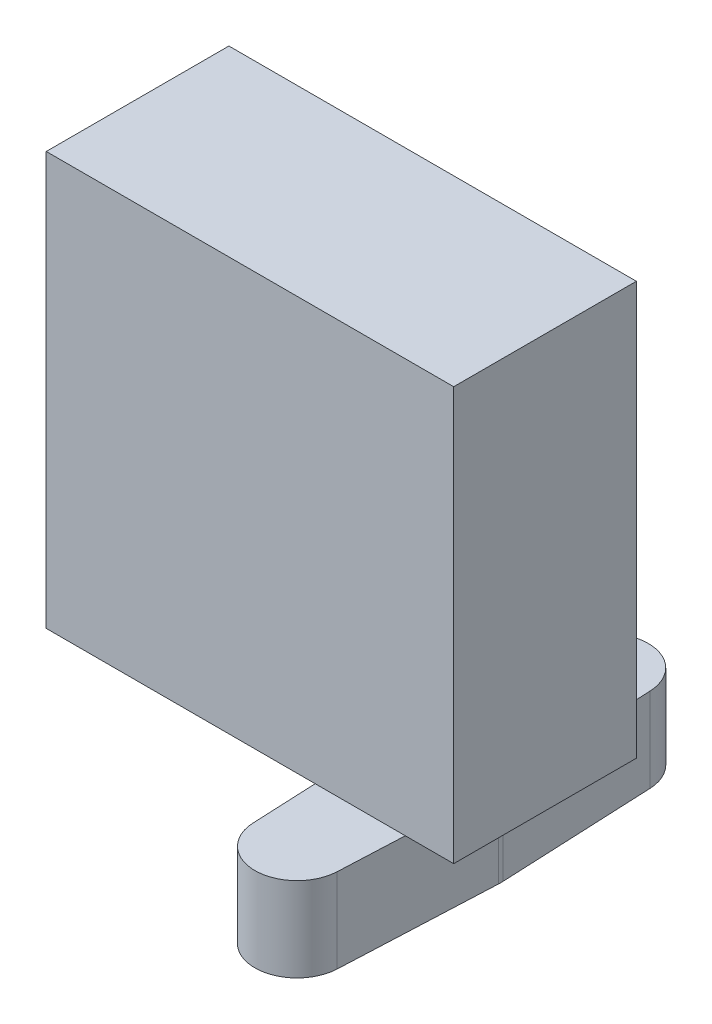
ISO-10303-21;
HEADER;
FILE_DESCRIPTION(('STEP AP214'),'2;1');
FILE_NAME('part.step','',(''),(''),'','','');
FILE_SCHEMA(('AUTOMOTIVE_DESIGN { 1 0 10303 214 1 1 1 1 }'));
ENDSEC;
DATA;
#1=APPLICATION_CONTEXT('core data for automotive mechanical design processes');
#2=APPLICATION_PROTOCOL_DEFINITION('international standard','automotive_design',2000,#1);
#3=PRODUCT_CONTEXT('',#1,'mechanical');
#4=PRODUCT('Part','Part','',(#3));
#5=PRODUCT_RELATED_PRODUCT_CATEGORY('part','',(#4));
#6=PRODUCT_DEFINITION_FORMATION('','',#4);
#7=PRODUCT_DEFINITION_CONTEXT('part definition',#1,'design');
#8=PRODUCT_DEFINITION('design','',#6,#7);
#9=PRODUCT_DEFINITION_SHAPE('','',#8);
#10=(LENGTH_UNIT() NAMED_UNIT(*) SI_UNIT(.MILLI.,.METRE.));
#11=(NAMED_UNIT(*) PLANE_ANGLE_UNIT() SI_UNIT($,.RADIAN.));
#12=(NAMED_UNIT(*) SI_UNIT($,.STERADIAN.) SOLID_ANGLE_UNIT());
#13=UNCERTAINTY_MEASURE_WITH_UNIT(LENGTH_MEASURE(1.E-05),#10,'distance_accuracy_value','');
#14=(GEOMETRIC_REPRESENTATION_CONTEXT(3) GLOBAL_UNCERTAINTY_ASSIGNED_CONTEXT((#13)) GLOBAL_UNIT_ASSIGNED_CONTEXT((#10,
#11,#12)) REPRESENTATION_CONTEXT('',''));
#15=CARTESIAN_POINT('',(0.,0.,0.));
#16=DIRECTION('',(0.,0.,1.));
#17=DIRECTION('',(1.,0.,0.));
#18=AXIS2_PLACEMENT_3D('',#15,#16,#17);
#19=CARTESIAN_POINT('',(7.85,-20.7,11.));
#20=DIRECTION('',(0.,1.,0.));
#21=DIRECTION('',(0.,0.,1.));
#22=AXIS2_PLACEMENT_3D('',#19,#20,#21);
#23=CYLINDRICAL_SURFACE('',#22,3.);
#24=CARTESIAN_POINT('',(7.85,-14.7,11.));
#25=DIRECTION('',(0.,-1.,0.));
#26=DIRECTION('',(0.,0.,-1.));
#27=AXIS2_PLACEMENT_3D('',#24,#25,#26);
#28=CIRCLE('',#27,3.);
#29=CARTESIAN_POINT('',(10.8468992239776,-14.7,11.1363636363636));
#30=VERTEX_POINT('',#29);
#31=CARTESIAN_POINT('',(4.85310077602238,-14.7,11.1363636363636));
#32=VERTEX_POINT('',#31);
#33=EDGE_CURVE('E141',#30,#32,#28,.T.);
#34=ORIENTED_EDGE('',*,*,#33,.T.);
#35=DIRECTION('',(0.,1.,0.));
#36=VECTOR('',#35,1.);
#37=CARTESIAN_POINT('',(4.85310077602238,-20.7,11.1363636363636));
#38=LINE('',#37,#36);
#39=CARTESIAN_POINT('',(4.85310077602238,-20.7,11.1363636363636));
#40=VERTEX_POINT('',#39);
#41=EDGE_CURVE('E12',#40,#32,#38,.T.);
#42=ORIENTED_EDGE('',*,*,#41,.F.);
#43=CARTESIAN_POINT('',(7.85,-20.7,11.));
#44=DIRECTION('',(0.,-1.,0.));
#45=DIRECTION('',(0.,0.,-1.));
#46=AXIS2_PLACEMENT_3D('',#43,#44,#45);
#47=CIRCLE('',#46,3.);
#48=CARTESIAN_POINT('',(10.8468992239776,-20.7,11.1363636363636));
#49=VERTEX_POINT('',#48);
#50=EDGE_CURVE('E155',#49,#40,#47,.T.);
#51=ORIENTED_EDGE('',*,*,#50,.F.);
#52=DIRECTION('',(0.,1.,0.));
#53=VECTOR('',#52,1.);
#54=CARTESIAN_POINT('',(10.8468992239776,-20.7,11.1363636363636));
#55=LINE('',#54,#53);
#56=EDGE_CURVE('E137',#49,#30,#55,.T.);
#57=ORIENTED_EDGE('',*,*,#56,.T.);
#58=EDGE_LOOP('',(#34,#42,#51,#57));
#59=FACE_BOUND('',#58,.T.);
#60=ADVANCED_FACE('F45',(#59),#23,.T.);
#61=CARTESIAN_POINT('',(4.85310077602238,-20.7,11.1363636363636));
#62=DIRECTION('',(0.998966407992541,0.,-0.0454545454545457));
#63=DIRECTION('',(-0.0454545454545457,0.,-0.998966407992542));
#64=AXIS2_PLACEMENT_3D('',#61,#62,#63);
#65=PLANE('',#64);
#66=DIRECTION('',(-0.0454545454545457,0.,-0.998966407992541));
#67=VECTOR('',#66,1.);
#68=CARTESIAN_POINT('',(4.85310077602238,-14.7,11.1363636363636));
#69=LINE('',#68,#67);
#70=CARTESIAN_POINT('',(4.3536175720261,-14.7,0.159090909090907));
#71=VERTEX_POINT('',#70);
#72=EDGE_CURVE('E144',#32,#71,#69,.T.);
#73=ORIENTED_EDGE('',*,*,#72,.T.);
#74=DIRECTION('',(0.,1.,0.));
#75=VECTOR('',#74,1.);
#76=CARTESIAN_POINT('',(4.3536175720261,-20.7,0.159090909090907));
#77=LINE('',#76,#75);
#78=CARTESIAN_POINT('',(4.3536175720261,-20.7,0.159090909090907));
#79=VERTEX_POINT('',#78);
#80=EDGE_CURVE('E53',#79,#71,#77,.T.);
#81=ORIENTED_EDGE('',*,*,#80,.F.);
#82=DIRECTION('',(-0.0454545454545457,0.,-0.998966407992541));
#83=VECTOR('',#82,1.);
#84=CARTESIAN_POINT('',(4.85310077602238,-20.7,11.1363636363636));
#85=LINE('',#84,#83);
#86=EDGE_CURVE('E104',#40,#79,#85,.T.);
#87=ORIENTED_EDGE('',*,*,#86,.F.);
#88=ORIENTED_EDGE('',*,*,#41,.T.);
#89=EDGE_LOOP('',(#73,#81,#87,#88));
#90=FACE_BOUND('',#89,.T.);
#91=ADVANCED_FACE('F190',(#90),#65,.F.);
#92=CARTESIAN_POINT('',(7.85,-20.7,0.));
#93=DIRECTION('',(0.,1.,0.));
#94=DIRECTION('',(0.,0.,1.));
#95=AXIS2_PLACEMENT_3D('',#92,#93,#94);
#96=CYLINDRICAL_SURFACE('',#95,3.5);
#97=CARTESIAN_POINT('',(7.85,-14.7,0.));
#98=DIRECTION('',(0.,-1.,0.));
#99=DIRECTION('',(0.,0.,-1.));
#100=AXIS2_PLACEMENT_3D('',#97,#98,#99);
#101=CIRCLE('',#100,3.5);
#102=CARTESIAN_POINT('',(4.3536175720261,-14.7,-0.159090909090905));
#103=VERTEX_POINT('',#102);
#104=EDGE_CURVE('E146',#71,#103,#101,.T.);
#105=ORIENTED_EDGE('',*,*,#104,.T.);
#106=DIRECTION('',(0.,1.,0.));
#107=VECTOR('',#106,1.);
#108=CARTESIAN_POINT('',(4.3536175720261,-20.7,-0.159090909090905));
#109=LINE('',#108,#107);
#110=CARTESIAN_POINT('',(4.3536175720261,-20.7,-0.159090909090905));
#111=VERTEX_POINT('',#110);
#112=EDGE_CURVE('E162',#111,#103,#109,.T.);
#113=ORIENTED_EDGE('',*,*,#112,.F.);
#114=CARTESIAN_POINT('',(7.85,-20.7,0.));
#115=DIRECTION('',(0.,-1.,0.));
#116=DIRECTION('',(0.,0.,-1.));
#117=AXIS2_PLACEMENT_3D('',#114,#115,#116);
#118=CIRCLE('',#117,3.5);
#119=EDGE_CURVE('E170',#79,#111,#118,.T.);
#120=ORIENTED_EDGE('',*,*,#119,.F.);
#121=ORIENTED_EDGE('',*,*,#80,.T.);
#122=EDGE_LOOP('',(#105,#113,#120,#121));
#123=FACE_BOUND('',#122,.T.);
#124=ADVANCED_FACE('F168',(#123),#96,.T.);
#125=CARTESIAN_POINT('',(4.3536175720261,-20.7,-0.159090909090907));
#126=DIRECTION('',(0.998966407992541,0.,0.0454545454545457));
#127=DIRECTION('',(0.0454545454545457,0.,-0.998966407992542));
#128=AXIS2_PLACEMENT_3D('',#125,#126,#127);
#129=PLANE('',#128);
#130=DIRECTION('',(0.0454545454545457,0.,-0.998966407992541));
#131=VECTOR('',#130,1.);
#132=CARTESIAN_POINT('',(4.3536175720261,-14.7,-0.159090909090907));
#133=LINE('',#132,#131);
#134=CARTESIAN_POINT('',(4.85310077602238,-14.7,-11.1363636363636));
#135=VERTEX_POINT('',#134);
#136=EDGE_CURVE('E148',#103,#135,#133,.T.);
#137=ORIENTED_EDGE('',*,*,#136,.T.);
#138=DIRECTION('',(0.,1.,0.));
#139=VECTOR('',#138,1.);
#140=CARTESIAN_POINT('',(4.85310077602238,-20.7,-11.1363636363636));
#141=LINE('',#140,#139);
#142=CARTESIAN_POINT('',(4.85310077602238,-20.7,-11.1363636363636));
#143=VERTEX_POINT('',#142);
#144=EDGE_CURVE('E159',#143,#135,#141,.T.);
#145=ORIENTED_EDGE('',*,*,#144,.F.);
#146=DIRECTION('',(0.0454545454545457,0.,-0.998966407992541));
#147=VECTOR('',#146,1.);
#148=CARTESIAN_POINT('',(4.3536175720261,-20.7,-0.159090909090907));
#149=LINE('',#148,#147);
#150=EDGE_CURVE('E182',#111,#143,#149,.T.);
#151=ORIENTED_EDGE('',*,*,#150,.F.);
#152=ORIENTED_EDGE('',*,*,#112,.T.);
#153=EDGE_LOOP('',(#137,#145,#151,#152));
#154=FACE_BOUND('',#153,.T.);
#155=ADVANCED_FACE('F178',(#154),#129,.F.);
#156=CARTESIAN_POINT('',(7.85,-20.7,-11.));
#157=DIRECTION('',(0.,1.,0.));
#158=DIRECTION('',(0.,0.,1.));
#159=AXIS2_PLACEMENT_3D('',#156,#157,#158);
#160=CYLINDRICAL_SURFACE('',#159,3.);
#161=CARTESIAN_POINT('',(7.85,-14.7,-11.));
#162=DIRECTION('',(0.,-1.,0.));
#163=DIRECTION('',(0.,0.,-1.));
#164=AXIS2_PLACEMENT_3D('',#161,#162,#163);
#165=CIRCLE('',#164,3.);
#166=CARTESIAN_POINT('',(10.8468992239776,-14.7,-11.1363636363636));
#167=VERTEX_POINT('',#166);
#168=EDGE_CURVE('E150',#135,#167,#165,.T.);
#169=ORIENTED_EDGE('',*,*,#168,.T.);
#170=DIRECTION('',(0.,1.,0.));
#171=VECTOR('',#170,1.);
#172=CARTESIAN_POINT('',(10.8468992239776,-20.7,-11.1363636363636));
#173=LINE('',#172,#171);
#174=CARTESIAN_POINT('',(10.8468992239776,-20.7,-11.1363636363636));
#175=VERTEX_POINT('',#174);
#176=EDGE_CURVE('E132',#175,#167,#173,.T.);
#177=ORIENTED_EDGE('',*,*,#176,.F.);
#178=CARTESIAN_POINT('',(7.85,-20.7,-11.));
#179=DIRECTION('',(0.,-1.,0.));
#180=DIRECTION('',(0.,0.,-1.));
#181=AXIS2_PLACEMENT_3D('',#178,#179,#180);
#182=CIRCLE('',#181,3.);
#183=EDGE_CURVE('E123',#143,#175,#182,.T.);
#184=ORIENTED_EDGE('',*,*,#183,.F.);
#185=ORIENTED_EDGE('',*,*,#144,.T.);
#186=EDGE_LOOP('',(#169,#177,#184,#185));
#187=FACE_BOUND('',#186,.T.);
#188=ADVANCED_FACE('F181',(#187),#160,.T.);
#189=CARTESIAN_POINT('',(10.8468992239776,-20.7,-11.1363636363636));
#190=DIRECTION('',(-0.998966407992541,0.,0.0454545454545457));
#191=DIRECTION('',(0.0454545454545457,0.,0.998966407992542));
#192=AXIS2_PLACEMENT_3D('',#189,#190,#191);
#193=PLANE('',#192);
#194=DIRECTION('',(0.0454545454545457,0.,0.998966407992541));
#195=VECTOR('',#194,1.);
#196=CARTESIAN_POINT('',(10.8468992239776,-14.7,-11.1363636363636));
#197=LINE('',#196,#195);
#198=CARTESIAN_POINT('',(11.3463824279739,-14.7,-0.159090909090907));
#199=VERTEX_POINT('',#198);
#200=EDGE_CURVE('E131',#167,#199,#197,.T.);
#201=ORIENTED_EDGE('',*,*,#200,.T.);
#202=DIRECTION('',(0.,1.,0.));
#203=VECTOR('',#202,1.);
#204=CARTESIAN_POINT('',(11.3463824279739,-20.7,-0.159090909090907));
#205=LINE('',#204,#203);
#206=CARTESIAN_POINT('',(11.3463824279739,-20.7,-0.159090909090907));
#207=VERTEX_POINT('',#206);
#208=EDGE_CURVE('E128',#207,#199,#205,.T.);
#209=ORIENTED_EDGE('',*,*,#208,.F.);
#210=DIRECTION('',(0.0454545454545457,0.,0.998966407992541));
#211=VECTOR('',#210,1.);
#212=CARTESIAN_POINT('',(10.8468992239776,-20.7,-11.1363636363636));
#213=LINE('',#212,#211);
#214=EDGE_CURVE('E117',#175,#207,#213,.T.);
#215=ORIENTED_EDGE('',*,*,#214,.F.);
#216=ORIENTED_EDGE('',*,*,#176,.T.);
#217=EDGE_LOOP('',(#201,#209,#215,#216));
#218=FACE_BOUND('',#217,.T.);
#219=ADVANCED_FACE('F129',(#218),#193,.F.);
#220=CARTESIAN_POINT('',(7.85,-20.7,0.));
#221=DIRECTION('',(0.,1.,0.));
#222=DIRECTION('',(0.,0.,1.));
#223=AXIS2_PLACEMENT_3D('',#220,#221,#222);
#224=CYLINDRICAL_SURFACE('',#223,3.5);
#225=CARTESIAN_POINT('',(7.85,-14.7,0.));
#226=DIRECTION('',(0.,-1.,0.));
#227=DIRECTION('',(0.,0.,-1.));
#228=AXIS2_PLACEMENT_3D('',#225,#226,#227);
#229=CIRCLE('',#228,3.5);
#230=CARTESIAN_POINT('',(11.3463824279739,-14.7,0.159090909090908));
#231=VERTEX_POINT('',#230);
#232=EDGE_CURVE('E90',#199,#231,#229,.T.);
#233=ORIENTED_EDGE('',*,*,#232,.T.);
#234=DIRECTION('',(0.,1.,0.));
#235=VECTOR('',#234,1.);
#236=CARTESIAN_POINT('',(11.3463824279739,-20.7,0.159090909090908));
#237=LINE('',#236,#235);
#238=CARTESIAN_POINT('',(11.3463824279739,-20.7,0.159090909090908));
#239=VERTEX_POINT('',#238);
#240=EDGE_CURVE('E133',#239,#231,#237,.T.);
#241=ORIENTED_EDGE('',*,*,#240,.F.);
#242=CARTESIAN_POINT('',(7.85,-20.7,0.));
#243=DIRECTION('',(0.,-1.,0.));
#244=DIRECTION('',(0.,0.,-1.));
#245=AXIS2_PLACEMENT_3D('',#242,#243,#244);
#246=CIRCLE('',#245,3.5);
#247=EDGE_CURVE('E121',#207,#239,#246,.T.);
#248=ORIENTED_EDGE('',*,*,#247,.F.);
#249=ORIENTED_EDGE('',*,*,#208,.T.);
#250=EDGE_LOOP('',(#233,#241,#248,#249));
#251=FACE_BOUND('',#250,.T.);
#252=ADVANCED_FACE('F135',(#251),#224,.T.);
#253=CARTESIAN_POINT('',(11.3463824279739,-20.7,0.159090909090907));
#254=DIRECTION('',(-0.998966407992541,0.,-0.0454545454545457));
#255=DIRECTION('',(-0.0454545454545457,0.,0.998966407992542));
#256=AXIS2_PLACEMENT_3D('',#253,#254,#255);
#257=PLANE('',#256);
#258=DIRECTION('',(-0.0454545454545457,0.,0.998966407992541));
#259=VECTOR('',#258,1.);
#260=CARTESIAN_POINT('',(11.3463824279739,-14.7,0.159090909090907));
#261=LINE('',#260,#259);
#262=EDGE_CURVE('E96',#231,#30,#261,.T.);
#263=ORIENTED_EDGE('',*,*,#262,.T.);
#264=ORIENTED_EDGE('',*,*,#56,.F.);
#265=DIRECTION('',(-0.0454545454545457,0.,0.998966407992541));
#266=VECTOR('',#265,1.);
#267=CARTESIAN_POINT('',(11.3463824279739,-20.7,0.159090909090907));
#268=LINE('',#267,#266);
#269=EDGE_CURVE('E61',#239,#49,#268,.T.);
#270=ORIENTED_EDGE('',*,*,#269,.F.);
#271=ORIENTED_EDGE('',*,*,#240,.T.);
#272=EDGE_LOOP('',(#263,#264,#270,#271));
#273=FACE_BOUND('',#272,.T.);
#274=ADVANCED_FACE('F206',(#273),#257,.F.);
#275=CARTESIAN_POINT('',(7.85,-20.7,11.));
#276=DIRECTION('',(0.,-1.,0.));
#277=DIRECTION('',(0.,0.,-1.));
#278=AXIS2_PLACEMENT_3D('',#275,#276,#277);
#279=PLANE('',#278);
#280=ORIENTED_EDGE('',*,*,#50,.T.);
#281=ORIENTED_EDGE('',*,*,#86,.T.);
#282=ORIENTED_EDGE('',*,*,#119,.T.);
#283=ORIENTED_EDGE('',*,*,#150,.T.);
#284=ORIENTED_EDGE('',*,*,#183,.T.);
#285=ORIENTED_EDGE('',*,*,#214,.T.);
#286=ORIENTED_EDGE('',*,*,#247,.T.);
#287=ORIENTED_EDGE('',*,*,#269,.T.);
#288=EDGE_LOOP('',(#280,#281,#282,#283,#284,#285,#286,#287));
#289=FACE_BOUND('',#288,.T.);
#290=ADVANCED_FACE('F119',(#289),#279,.T.);
#291=CARTESIAN_POINT('',(7.85,-14.7,11.));
#292=DIRECTION('',(0.,-1.,0.));
#293=DIRECTION('',(0.,0.,-1.));
#294=AXIS2_PLACEMENT_3D('',#291,#292,#293);
#295=PLANE('',#294);
#296=ORIENTED_EDGE('',*,*,#33,.F.);
#297=ORIENTED_EDGE('',*,*,#262,.F.);
#298=ORIENTED_EDGE('',*,*,#232,.F.);
#299=ORIENTED_EDGE('',*,*,#200,.F.);
#300=ORIENTED_EDGE('',*,*,#168,.F.);
#301=ORIENTED_EDGE('',*,*,#136,.F.);
#302=ORIENTED_EDGE('',*,*,#104,.F.);
#303=ORIENTED_EDGE('',*,*,#72,.F.);
#304=EDGE_LOOP('',(#296,#297,#298,#299,#300,#301,#302,#303));
#305=FACE_BOUND('',#304,.T.);
#306=ADVANCED_FACE('F174',(#305),#295,.F.);
#307=CLOSED_SHELL('',(#60,#91,#124,#155,#188,#219,#252,#274,#290,#306));
#308=MANIFOLD_SOLID_BREP('B2',#307);
#309=CARTESIAN_POINT('',(14.5000000000001,-14.7,6.5));
#310=DIRECTION('',(-1.,0.,0.));
#311=DIRECTION('',(0.,0.,1.));
#312=AXIS2_PLACEMENT_3D('',#309,#310,#311);
#313=PLANE('',#312);
#314=DIRECTION('',(0.,1.,0.));
#315=VECTOR('',#314,1.);
#316=CARTESIAN_POINT('',(14.5000000000001,-14.7,-6.5));
#317=LINE('',#316,#315);
#318=CARTESIAN_POINT('',(14.5000000000001,-14.7,-6.5));
#319=VERTEX_POINT('',#318);
#320=CARTESIAN_POINT('',(14.5000000000001,14.7,-6.5));
#321=VERTEX_POINT('',#320);
#322=EDGE_CURVE('E336',#319,#321,#317,.T.);
#323=ORIENTED_EDGE('',*,*,#322,.T.);
#324=DIRECTION('',(0.,0.,-1.));
#325=VECTOR('',#324,1.);
#326=CARTESIAN_POINT('',(14.5000000000001,14.7,6.5));
#327=LINE('',#326,#325);
#328=CARTESIAN_POINT('',(14.5000000000001,14.7,6.5));
#329=VERTEX_POINT('',#328);
#330=EDGE_CURVE('E43',#329,#321,#327,.T.);
#331=ORIENTED_EDGE('',*,*,#330,.F.);
#332=DIRECTION('',(0.,1.,0.));
#333=VECTOR('',#332,1.);
#334=CARTESIAN_POINT('',(14.5000000000001,-14.7,6.5));
#335=LINE('',#334,#333);
#336=CARTESIAN_POINT('',(14.5000000000001,-14.7,6.5));
#337=VERTEX_POINT('',#336);
#338=EDGE_CURVE('E324',#337,#329,#335,.T.);
#339=ORIENTED_EDGE('',*,*,#338,.F.);
#340=DIRECTION('',(0.,0.,-1.));
#341=VECTOR('',#340,1.);
#342=CARTESIAN_POINT('',(14.5000000000001,-14.7,6.5));
#343=LINE('',#342,#341);
#344=EDGE_CURVE('E332',#337,#319,#343,.T.);
#345=ORIENTED_EDGE('',*,*,#344,.T.);
#346=EDGE_LOOP('',(#323,#331,#339,#345));
#347=FACE_BOUND('',#346,.T.);
#348=ADVANCED_FACE('F273',(#347),#313,.F.);
#349=CARTESIAN_POINT('',(-14.5,14.7,6.5));
#350=DIRECTION('',(0.,-1.,0.));
#351=DIRECTION('',(0.,0.,-1.));
#352=AXIS2_PLACEMENT_3D('',#349,#350,#351);
#353=PLANE('',#352);
#354=DIRECTION('',(-1.,0.,0.));
#355=VECTOR('',#354,1.);
#356=CARTESIAN_POINT('',(-14.5,14.7,-6.5));
#357=LINE('',#356,#355);
#358=CARTESIAN_POINT('',(-14.5,14.7,-6.5));
#359=VERTEX_POINT('',#358);
#360=EDGE_CURVE('E328',#321,#359,#357,.T.);
#361=ORIENTED_EDGE('',*,*,#360,.T.);
#362=DIRECTION('',(0.,0.,-1.));
#363=VECTOR('',#362,1.);
#364=CARTESIAN_POINT('',(-14.5,14.7,6.5));
#365=LINE('',#364,#363);
#366=CARTESIAN_POINT('',(-14.5,14.7,6.5));
#367=VERTEX_POINT('',#366);
#368=EDGE_CURVE('E281',#367,#359,#365,.T.);
#369=ORIENTED_EDGE('',*,*,#368,.F.);
#370=DIRECTION('',(-1.,0.,0.));
#371=VECTOR('',#370,1.);
#372=CARTESIAN_POINT('',(-14.5,14.7,6.5));
#373=LINE('',#372,#371);
#374=EDGE_CURVE('E319',#329,#367,#373,.T.);
#375=ORIENTED_EDGE('',*,*,#374,.F.);
#376=ORIENTED_EDGE('',*,*,#330,.T.);
#377=EDGE_LOOP('',(#361,#369,#375,#376));
#378=FACE_BOUND('',#377,.T.);
#379=ADVANCED_FACE('F327',(#378),#353,.F.);
#380=CARTESIAN_POINT('',(-14.5,-14.7,6.5));
#381=DIRECTION('',(1.,0.,0.));
#382=DIRECTION('',(0.,0.,-1.));
#383=AXIS2_PLACEMENT_3D('',#380,#381,#382);
#384=PLANE('',#383);
#385=DIRECTION('',(0.,-1.,0.));
#386=VECTOR('',#385,1.);
#387=CARTESIAN_POINT('',(-14.5,-14.7,-6.5));
#388=LINE('',#387,#386);
#389=CARTESIAN_POINT('',(-14.5,-14.7,-6.5));
#390=VERTEX_POINT('',#389);
#391=EDGE_CURVE('E306',#359,#390,#388,.T.);
#392=ORIENTED_EDGE('',*,*,#391,.T.);
#393=DIRECTION('',(0.,0.,-1.));
#394=VECTOR('',#393,1.);
#395=CARTESIAN_POINT('',(-14.5,-14.7,6.5));
#396=LINE('',#395,#394);
#397=CARTESIAN_POINT('',(-14.5,-14.7,6.5));
#398=VERTEX_POINT('',#397);
#399=EDGE_CURVE('E329',#398,#390,#396,.T.);
#400=ORIENTED_EDGE('',*,*,#399,.F.);
#401=DIRECTION('',(0.,-1.,0.));
#402=VECTOR('',#401,1.);
#403=CARTESIAN_POINT('',(-14.5,-14.7,6.5));
#404=LINE('',#403,#402);
#405=EDGE_CURVE('E322',#367,#398,#404,.T.);
#406=ORIENTED_EDGE('',*,*,#405,.F.);
#407=ORIENTED_EDGE('',*,*,#368,.T.);
#408=EDGE_LOOP('',(#392,#400,#406,#407));
#409=FACE_BOUND('',#408,.T.);
#410=ADVANCED_FACE('F330',(#409),#384,.F.);
#411=CARTESIAN_POINT('',(-14.5,-14.7,6.5));
#412=DIRECTION('',(0.,1.,0.));
#413=DIRECTION('',(0.,0.,1.));
#414=AXIS2_PLACEMENT_3D('',#411,#412,#413);
#415=PLANE('',#414);
#416=DIRECTION('',(1.,0.,0.));
#417=VECTOR('',#416,1.);
#418=CARTESIAN_POINT('',(-14.5,-14.7,-6.5));
#419=LINE('',#418,#417);
#420=EDGE_CURVE('E312',#390,#319,#419,.T.);
#421=ORIENTED_EDGE('',*,*,#420,.T.);
#422=ORIENTED_EDGE('',*,*,#344,.F.);
#423=DIRECTION('',(1.,0.,0.));
#424=VECTOR('',#423,1.);
#425=CARTESIAN_POINT('',(-14.5,-14.7,6.5));
#426=LINE('',#425,#424);
#427=EDGE_CURVE('E289',#398,#337,#426,.T.);
#428=ORIENTED_EDGE('',*,*,#427,.F.);
#429=ORIENTED_EDGE('',*,*,#399,.T.);
#430=EDGE_LOOP('',(#421,#422,#428,#429));
#431=FACE_BOUND('',#430,.T.);
#432=ADVANCED_FACE('F343',(#431),#415,.F.);
#433=CARTESIAN_POINT('',(0.,0.,6.5));
#434=DIRECTION('',(0.,0.,-1.));
#435=DIRECTION('',(-1.,0.,0.));
#436=AXIS2_PLACEMENT_3D('',#433,#434,#435);
#437=PLANE('',#436);
#438=ORIENTED_EDGE('',*,*,#338,.T.);
#439=ORIENTED_EDGE('',*,*,#374,.T.);
#440=ORIENTED_EDGE('',*,*,#405,.T.);
#441=ORIENTED_EDGE('',*,*,#427,.T.);
#442=EDGE_LOOP('',(#438,#439,#440,#441));
#443=FACE_BOUND('',#442,.T.);
#444=ADVANCED_FACE('F320',(#443),#437,.F.);
#445=CARTESIAN_POINT('',(0.,0.,-6.5));
#446=DIRECTION('',(0.,0.,-1.));
#447=DIRECTION('',(-1.,0.,0.));
#448=AXIS2_PLACEMENT_3D('',#445,#446,#447);
#449=PLANE('',#448);
#450=ORIENTED_EDGE('',*,*,#322,.F.);
#451=ORIENTED_EDGE('',*,*,#420,.F.);
#452=ORIENTED_EDGE('',*,*,#391,.F.);
#453=ORIENTED_EDGE('',*,*,#360,.F.);
#454=EDGE_LOOP('',(#450,#451,#452,#453));
#455=FACE_BOUND('',#454,.T.);
#456=ADVANCED_FACE('F346',(#455),#449,.T.);
#457=CLOSED_SHELL('',(#348,#379,#410,#432,#444,#456));
#458=MANIFOLD_SOLID_BREP('B6',#457);
#459=ADVANCED_BREP_SHAPE_REPRESENTATION('',(#18,#308,#458),#14);
#460=SHAPE_DEFINITION_REPRESENTATION(#9,#459);
ENDSEC;
END-ISO-10303-21;
